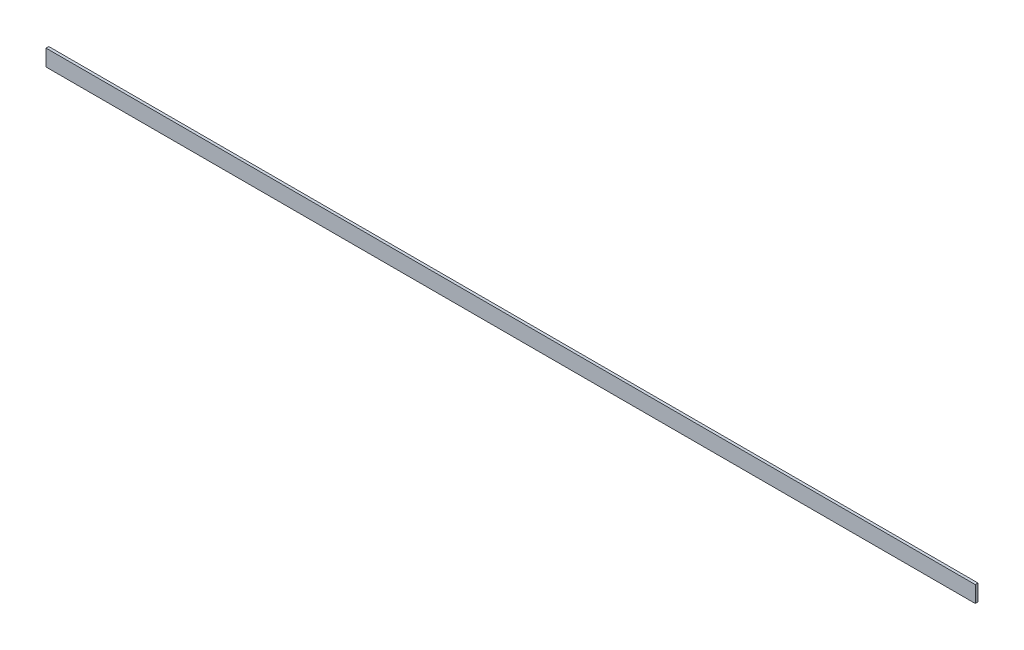
ISO-10303-21;
HEADER;
FILE_DESCRIPTION(('STEP AP214'),'2;1');
FILE_NAME('part.step','',(''),(''),'','','');
FILE_SCHEMA(('AUTOMOTIVE_DESIGN { 1 0 10303 214 1 1 1 1 }'));
ENDSEC;
DATA;
#1=APPLICATION_CONTEXT('core data for automotive mechanical design processes');
#2=APPLICATION_PROTOCOL_DEFINITION('international standard','automotive_design',2000,#1);
#3=PRODUCT_CONTEXT('',#1,'mechanical');
#4=PRODUCT('Part','Part','',(#3));
#5=PRODUCT_RELATED_PRODUCT_CATEGORY('part','',(#4));
#6=PRODUCT_DEFINITION_FORMATION('','',#4);
#7=PRODUCT_DEFINITION_CONTEXT('part definition',#1,'design');
#8=PRODUCT_DEFINITION('design','',#6,#7);
#9=PRODUCT_DEFINITION_SHAPE('','',#8);
#10=(LENGTH_UNIT() NAMED_UNIT(*) SI_UNIT(.MILLI.,.METRE.));
#11=(NAMED_UNIT(*) PLANE_ANGLE_UNIT() SI_UNIT($,.RADIAN.));
#12=(NAMED_UNIT(*) SI_UNIT($,.STERADIAN.) SOLID_ANGLE_UNIT());
#13=UNCERTAINTY_MEASURE_WITH_UNIT(LENGTH_MEASURE(1.E-05),#10,'distance_accuracy_value','');
#14=(GEOMETRIC_REPRESENTATION_CONTEXT(3) GLOBAL_UNCERTAINTY_ASSIGNED_CONTEXT((#13)) GLOBAL_UNIT_ASSIGNED_CONTEXT((#10,
#11,#12)) REPRESENTATION_CONTEXT('',''));
#15=CARTESIAN_POINT('',(0.,0.,0.));
#16=DIRECTION('',(0.,0.,1.));
#17=DIRECTION('',(1.,0.,0.));
#18=AXIS2_PLACEMENT_3D('',#15,#16,#17);
#19=CARTESIAN_POINT('',(1700.,0.,0.));
#20=DIRECTION('',(0.,0.,-1.));
#21=DIRECTION('',(-1.,0.,0.));
#22=AXIS2_PLACEMENT_3D('',#19,#20,#21);
#23=PLANE('',#22);
#24=DIRECTION('',(0.,-1.,0.));
#25=VECTOR('',#24,1.);
#26=CARTESIAN_POINT('',(0.,0.,0.));
#27=LINE('',#26,#25);
#28=CARTESIAN_POINT('',(0.,30.,0.));
#29=VERTEX_POINT('',#28);
#30=CARTESIAN_POINT('',(0.,0.,0.));
#31=VERTEX_POINT('',#30);
#32=EDGE_CURVE('E107',#29,#31,#27,.T.);
#33=ORIENTED_EDGE('',*,*,#32,.T.);
#34=DIRECTION('',(-1.,0.,0.));
#35=VECTOR('',#34,1.);
#36=CARTESIAN_POINT('',(1700.,0.,0.));
#37=LINE('',#36,#35);
#38=CARTESIAN_POINT('',(1700.,0.,0.));
#39=VERTEX_POINT('',#38);
#40=EDGE_CURVE('E11',#39,#31,#37,.T.);
#41=ORIENTED_EDGE('',*,*,#40,.F.);
#42=DIRECTION('',(0.,-1.,0.));
#43=VECTOR('',#42,1.);
#44=CARTESIAN_POINT('',(1700.,0.,0.));
#45=LINE('',#44,#43);
#46=CARTESIAN_POINT('',(1700.,30.,0.));
#47=VERTEX_POINT('',#46);
#48=EDGE_CURVE('E91',#47,#39,#45,.T.);
#49=ORIENTED_EDGE('',*,*,#48,.F.);
#50=DIRECTION('',(-1.,0.,0.));
#51=VECTOR('',#50,1.);
#52=CARTESIAN_POINT('',(1700.,30.,0.));
#53=LINE('',#52,#51);
#54=EDGE_CURVE('E103',#47,#29,#53,.T.);
#55=ORIENTED_EDGE('',*,*,#54,.T.);
#56=EDGE_LOOP('',(#33,#41,#49,#55));
#57=FACE_BOUND('',#56,.T.);
#58=ADVANCED_FACE('F39',(#57),#23,.F.);
#59=CARTESIAN_POINT('',(1700.,0.,0.));
#60=DIRECTION('',(0.,1.,0.));
#61=DIRECTION('',(0.,0.,1.));
#62=AXIS2_PLACEMENT_3D('',#59,#60,#61);
#63=PLANE('',#62);
#64=DIRECTION('',(0.,0.,-1.));
#65=VECTOR('',#64,1.);
#66=CARTESIAN_POINT('',(0.,0.,0.));
#67=LINE('',#66,#65);
#68=CARTESIAN_POINT('',(0.,0.,-5.));
#69=VERTEX_POINT('',#68);
#70=EDGE_CURVE('E96',#31,#69,#67,.T.);
#71=ORIENTED_EDGE('',*,*,#70,.T.);
#72=DIRECTION('',(-1.,0.,0.));
#73=VECTOR('',#72,1.);
#74=CARTESIAN_POINT('',(1700.,0.,-5.));
#75=LINE('',#74,#73);
#76=CARTESIAN_POINT('',(1700.,0.,-5.));
#77=VERTEX_POINT('',#76);
#78=EDGE_CURVE('E48',#77,#69,#75,.T.);
#79=ORIENTED_EDGE('',*,*,#78,.F.);
#80=DIRECTION('',(0.,0.,-1.));
#81=VECTOR('',#80,1.);
#82=CARTESIAN_POINT('',(1700.,0.,0.));
#83=LINE('',#82,#81);
#84=EDGE_CURVE('E86',#39,#77,#83,.T.);
#85=ORIENTED_EDGE('',*,*,#84,.F.);
#86=ORIENTED_EDGE('',*,*,#40,.T.);
#87=EDGE_LOOP('',(#71,#79,#85,#86));
#88=FACE_BOUND('',#87,.T.);
#89=ADVANCED_FACE('F95',(#88),#63,.F.);
#90=CARTESIAN_POINT('',(1700.,0.,-5.));
#91=DIRECTION('',(0.,0.,1.));
#92=DIRECTION('',(1.,0.,0.));
#93=AXIS2_PLACEMENT_3D('',#90,#91,#92);
#94=PLANE('',#93);
#95=DIRECTION('',(0.,1.,0.));
#96=VECTOR('',#95,1.);
#97=CARTESIAN_POINT('',(0.,0.,-5.));
#98=LINE('',#97,#96);
#99=CARTESIAN_POINT('',(0.,30.,-5.));
#100=VERTEX_POINT('',#99);
#101=EDGE_CURVE('E73',#69,#100,#98,.T.);
#102=ORIENTED_EDGE('',*,*,#101,.T.);
#103=DIRECTION('',(-1.,0.,0.));
#104=VECTOR('',#103,1.);
#105=CARTESIAN_POINT('',(1700.,30.,-5.));
#106=LINE('',#105,#104);
#107=CARTESIAN_POINT('',(1700.,30.,-5.));
#108=VERTEX_POINT('',#107);
#109=EDGE_CURVE('E98',#108,#100,#106,.T.);
#110=ORIENTED_EDGE('',*,*,#109,.F.);
#111=DIRECTION('',(0.,1.,0.));
#112=VECTOR('',#111,1.);
#113=CARTESIAN_POINT('',(1700.,0.,-5.));
#114=LINE('',#113,#112);
#115=EDGE_CURVE('E89',#77,#108,#114,.T.);
#116=ORIENTED_EDGE('',*,*,#115,.F.);
#117=ORIENTED_EDGE('',*,*,#78,.T.);
#118=EDGE_LOOP('',(#102,#110,#116,#117));
#119=FACE_BOUND('',#118,.T.);
#120=ADVANCED_FACE('F99',(#119),#94,.F.);
#121=CARTESIAN_POINT('',(1700.,30.,0.));
#122=DIRECTION('',(0.,-1.,0.));
#123=DIRECTION('',(0.,0.,-1.));
#124=AXIS2_PLACEMENT_3D('',#121,#122,#123);
#125=PLANE('',#124);
#126=DIRECTION('',(0.,0.,1.));
#127=VECTOR('',#126,1.);
#128=CARTESIAN_POINT('',(0.,30.,0.));
#129=LINE('',#128,#127);
#130=EDGE_CURVE('E79',#100,#29,#129,.T.);
#131=ORIENTED_EDGE('',*,*,#130,.T.);
#132=ORIENTED_EDGE('',*,*,#54,.F.);
#133=DIRECTION('',(0.,0.,1.));
#134=VECTOR('',#133,1.);
#135=CARTESIAN_POINT('',(1700.,30.,0.));
#136=LINE('',#135,#134);
#137=EDGE_CURVE('E56',#108,#47,#136,.T.);
#138=ORIENTED_EDGE('',*,*,#137,.F.);
#139=ORIENTED_EDGE('',*,*,#109,.T.);
#140=EDGE_LOOP('',(#131,#132,#138,#139));
#141=FACE_BOUND('',#140,.T.);
#142=ADVANCED_FACE('F120',(#141),#125,.F.);
#143=CARTESIAN_POINT('',(1700.,0.,0.));
#144=DIRECTION('',(-1.,0.,0.));
#145=DIRECTION('',(0.,0.,1.));
#146=AXIS2_PLACEMENT_3D('',#143,#144,#145);
#147=PLANE('',#146);
#148=ORIENTED_EDGE('',*,*,#48,.T.);
#149=ORIENTED_EDGE('',*,*,#84,.T.);
#150=ORIENTED_EDGE('',*,*,#115,.T.);
#151=ORIENTED_EDGE('',*,*,#137,.T.);
#152=EDGE_LOOP('',(#148,#149,#150,#151));
#153=FACE_BOUND('',#152,.T.);
#154=ADVANCED_FACE('F87',(#153),#147,.F.);
#155=CARTESIAN_POINT('',(0.,0.,0.));
#156=DIRECTION('',(-1.,0.,0.));
#157=DIRECTION('',(0.,0.,1.));
#158=AXIS2_PLACEMENT_3D('',#155,#156,#157);
#159=PLANE('',#158);
#160=ORIENTED_EDGE('',*,*,#32,.F.);
#161=ORIENTED_EDGE('',*,*,#130,.F.);
#162=ORIENTED_EDGE('',*,*,#101,.F.);
#163=ORIENTED_EDGE('',*,*,#70,.F.);
#164=EDGE_LOOP('',(#160,#161,#162,#163));
#165=FACE_BOUND('',#164,.T.);
#166=ADVANCED_FACE('F123',(#165),#159,.T.);
#167=CLOSED_SHELL('',(#58,#89,#120,#142,#154,#166));
#168=MANIFOLD_SOLID_BREP('B2',#167);
#169=ADVANCED_BREP_SHAPE_REPRESENTATION('',(#18,#168),#14);
#170=SHAPE_DEFINITION_REPRESENTATION(#9,#169);
ENDSEC;
END-ISO-10303-21;
